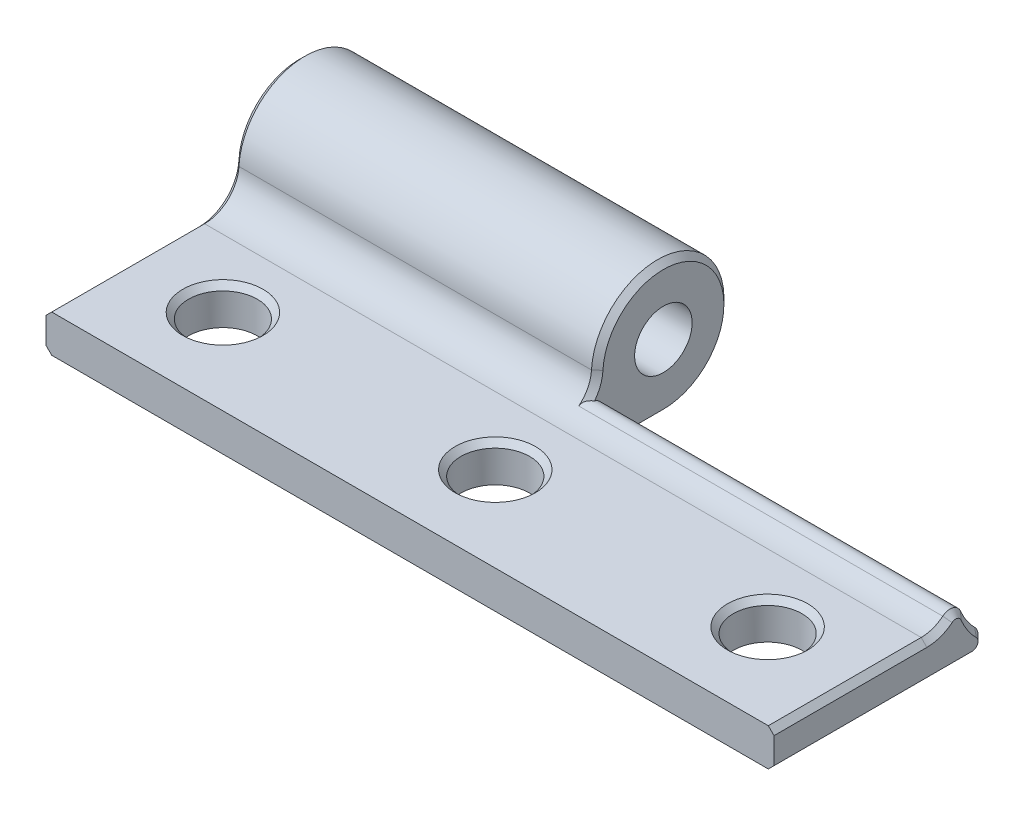
ISO-10303-21;
HEADER;
FILE_DESCRIPTION(('STEP AP214'),'2;1');
FILE_NAME('part.step','',(''),(''),'','','');
FILE_SCHEMA(('AUTOMOTIVE_DESIGN { 1 0 10303 214 1 1 1 1 }'));
ENDSEC;
DATA;
#1=APPLICATION_CONTEXT('core data for automotive mechanical design processes');
#2=APPLICATION_PROTOCOL_DEFINITION('international standard','automotive_design',2000,#1);
#3=PRODUCT_CONTEXT('',#1,'mechanical');
#4=PRODUCT('Part','Part','',(#3));
#5=PRODUCT_RELATED_PRODUCT_CATEGORY('part','',(#4));
#6=PRODUCT_DEFINITION_FORMATION('','',#4);
#7=PRODUCT_DEFINITION_CONTEXT('part definition',#1,'design');
#8=PRODUCT_DEFINITION('design','',#6,#7);
#9=PRODUCT_DEFINITION_SHAPE('','',#8);
#10=(LENGTH_UNIT() NAMED_UNIT(*) SI_UNIT(.MILLI.,.METRE.));
#11=(NAMED_UNIT(*) PLANE_ANGLE_UNIT() SI_UNIT($,.RADIAN.));
#12=(NAMED_UNIT(*) SI_UNIT($,.STERADIAN.) SOLID_ANGLE_UNIT());
#13=UNCERTAINTY_MEASURE_WITH_UNIT(LENGTH_MEASURE(1.E-05),#10,'distance_accuracy_value','');
#14=(GEOMETRIC_REPRESENTATION_CONTEXT(3) GLOBAL_UNCERTAINTY_ASSIGNED_CONTEXT((#13)) GLOBAL_UNIT_ASSIGNED_CONTEXT((#10,
#11,#12)) REPRESENTATION_CONTEXT('',''));
#15=CARTESIAN_POINT('',(0.,0.,0.));
#16=DIRECTION('',(0.,0.,1.));
#17=DIRECTION('',(1.,0.,0.));
#18=AXIS2_PLACEMENT_3D('',#15,#16,#17);
#19=CARTESIAN_POINT('',(31.75,0.490969286456826,8.76580042059178));
#20=DIRECTION('',(1.,0.,0.));
#21=DIRECTION('',(0.,0.,-1.));
#22=AXIS2_PLACEMENT_3D('',#19,#20,#21);
#23=PLANE('',#22);
#24=DIRECTION('',(0.,-1.,0.));
#25=VECTOR('',#24,1.);
#26=CARTESIAN_POINT('',(31.75,-5.77953915953969,22.098));
#27=LINE('',#26,#25);
#28=CARTESIAN_POINT('',(31.75,-3.00903071354318,22.098));
#29=VERTEX_POINT('',#28);
#30=CARTESIAN_POINT('',(31.75,-5.27953915953969,22.098));
#31=VERTEX_POINT('',#30);
#32=EDGE_CURVE('E433',#29,#31,#27,.T.);
#33=ORIENTED_EDGE('',*,*,#32,.T.);
#34=DIRECTION('',(0.,0.,-1.));
#35=VECTOR('',#34,1.);
#36=CARTESIAN_POINT('',(31.75,-5.27953915953969,4.80813442388613));
#37=LINE('',#36,#35);
#38=CARTESIAN_POINT('',(31.75,-5.27953915953969,4.80813442388613));
#39=VERTEX_POINT('',#38);
#40=EDGE_CURVE('E226',#31,#39,#37,.T.);
#41=ORIENTED_EDGE('',*,*,#40,.T.);
#42=CARTESIAN_POINT('',(31.75,-4.77953915953969,4.80813442388613));
#43=DIRECTION('',(1.,0.,0.));
#44=DIRECTION('',(0.,0.,-1.));
#45=AXIS2_PLACEMENT_3D('',#42,#43,#44);
#46=CIRCLE('',#45,0.499999999999999);
#47=CARTESIAN_POINT('',(31.75,-4.42704181074761,4.4535281364425));
#48=VERTEX_POINT('',#47);
#49=EDGE_CURVE('E224',#39,#48,#46,.T.);
#50=ORIENTED_EDGE('',*,*,#49,.T.);
#51=CARTESIAN_POINT('',(31.75,0.,0.));
#52=DIRECTION('',(1.,0.,0.));
#53=DIRECTION('',(0.,0.,-1.));
#54=AXIS2_PLACEMENT_3D('',#51,#52,#53);
#55=CIRCLE('',#54,6.27953915953969);
#56=CARTESIAN_POINT('',(31.75,-2.42752736320503,5.79134897559137));
#57=VERTEX_POINT('',#56);
#58=EDGE_CURVE('E222',#48,#57,#55,.F.);
#59=ORIENTED_EDGE('',*,*,#58,.T.);
#60=CARTESIAN_POINT('',(31.75,-2.62081601875209,6.25247747789503));
#61=DIRECTION('',(1.,0.,0.));
#62=DIRECTION('',(0.,0.,-1.));
#63=AXIS2_PLACEMENT_3D('',#60,#61,#62);
#64=CIRCLE('',#63,0.5);
#65=CARTESIAN_POINT('',(31.75,-2.23184285560098,6.56664284573212));
#66=VERTEX_POINT('',#65);
#67=EDGE_CURVE('E220',#57,#66,#64,.T.);
#68=ORIENTED_EDGE('',*,*,#67,.T.);
#69=CARTESIAN_POINT('',(31.75,0.490969286456826,8.76580042059178));
#70=DIRECTION('',(1.,0.,0.));
#71=DIRECTION('',(0.,0.,-1.));
#72=AXIS2_PLACEMENT_3D('',#69,#70,#71);
#73=CIRCLE('',#72,3.5);
#74=CARTESIAN_POINT('',(31.75,-3.00903071354317,8.76580042059178));
#75=VERTEX_POINT('',#74);
#76=EDGE_CURVE('E218',#66,#75,#73,.F.);
#77=ORIENTED_EDGE('',*,*,#76,.T.);
#78=DIRECTION('',(0.,0.,1.));
#79=VECTOR('',#78,1.);
#80=CARTESIAN_POINT('',(31.75,-3.00903071354318,22.098));
#81=LINE('',#80,#79);
#82=EDGE_CURVE('E216',#75,#29,#81,.T.);
#83=ORIENTED_EDGE('',*,*,#82,.T.);
#84=EDGE_LOOP('',(#33,#41,#50,#59,#68,#77,#83));
#85=FACE_BOUND('',#84,.T.);
#86=ADVANCED_FACE('F33',(#85),#23,.T.);
#87=CARTESIAN_POINT('',(31.75,0.,0.));
#88=DIRECTION('',(-1.,0.,0.));
#89=DIRECTION('',(0.,0.,1.));
#90=AXIS2_PLACEMENT_3D('',#87,#88,#89);
#91=CYLINDRICAL_SURFACE('',#90,5.77953915953969);
#92=DIRECTION('',(-1.,0.,0.));
#93=VECTOR('',#92,1.);
#94=CARTESIAN_POINT('',(31.75,-5.77953915953969,0.));
#95=LINE('',#94,#93);
#96=CARTESIAN_POINT('',(-0.499999999999987,-5.77953915953969,0.));
#97=VERTEX_POINT('',#96);
#98=CARTESIAN_POINT('',(-31.25,-5.77953915953969,0.));
#99=VERTEX_POINT('',#98);
#100=EDGE_CURVE('E437',#97,#99,#95,.T.);
#101=ORIENTED_EDGE('',*,*,#100,.T.);
#102=CARTESIAN_POINT('',(-31.25,0.,0.));
#103=DIRECTION('',(1.,0.,0.));
#104=DIRECTION('',(0.,0.,-1.));
#105=AXIS2_PLACEMENT_3D('',#102,#103,#104);
#106=CIRCLE('',#105,5.77953915953969);
#107=CARTESIAN_POINT('',(-31.25,0.323203321455121,5.77049499693511));
#108=VERTEX_POINT('',#107);
#109=EDGE_CURVE('E265',#99,#108,#106,.T.);
#110=ORIENTED_EDGE('',*,*,#109,.T.);
#111=DIRECTION('',(-1.,0.,0.));
#112=VECTOR('',#111,1.);
#113=CARTESIAN_POINT('',(31.75,0.323203321455121,5.77049499693511));
#114=LINE('',#113,#112);
#115=CARTESIAN_POINT('',(-0.499999999999987,0.323203321455121,5.77049499693511));
#116=VERTEX_POINT('',#115);
#117=EDGE_CURVE('E434',#116,#108,#114,.T.);
#118=ORIENTED_EDGE('',*,*,#117,.F.);
#119=CARTESIAN_POINT('',(-0.499999999999987,0.,0.));
#120=DIRECTION('',(1.,0.,0.));
#121=DIRECTION('',(0.,0.,-1.));
#122=AXIS2_PLACEMENT_3D('',#119,#120,#121);
#123=CIRCLE('',#122,5.77953915953969);
#124=EDGE_CURVE('E263',#116,#97,#123,.F.);
#125=ORIENTED_EDGE('',*,*,#124,.T.);
#126=EDGE_LOOP('',(#101,#110,#118,#125));
#127=FACE_BOUND('',#126,.T.);
#128=ADVANCED_FACE('F349',(#127),#91,.T.);
#129=CARTESIAN_POINT('',(31.75,0.,0.));
#130=DIRECTION('',(-1.,0.,0.));
#131=DIRECTION('',(0.,0.,1.));
#132=AXIS2_PLACEMENT_3D('',#129,#130,#131);
#133=CYLINDRICAL_SURFACE('',#132,2.50903071354317);
#134=CARTESIAN_POINT('',(-31.75,0.,0.));
#135=DIRECTION('',(1.,0.,0.));
#136=DIRECTION('',(0.,0.,-1.));
#137=AXIS2_PLACEMENT_3D('',#134,#135,#136);
#138=CIRCLE('',#137,2.50903071354317);
#139=CARTESIAN_POINT('',(-31.75,0.,-2.50903071354317));
#140=VERTEX_POINT('',#139);
#141=EDGE_CURVE('E440',#140,#140,#138,.T.);
#142=ORIENTED_EDGE('',*,*,#141,.F.);
#143=EDGE_LOOP('',(#142));
#144=FACE_BOUND('',#143,.T.);
#145=CARTESIAN_POINT('',(0.,0.,0.));
#146=DIRECTION('',(1.,0.,0.));
#147=DIRECTION('',(0.,0.,-1.));
#148=AXIS2_PLACEMENT_3D('',#145,#146,#147);
#149=CIRCLE('',#148,2.50903071354317);
#150=CARTESIAN_POINT('',(0.,0.,-2.50903071354317));
#151=VERTEX_POINT('',#150);
#152=EDGE_CURVE('E173',#151,#151,#149,.T.);
#153=ORIENTED_EDGE('',*,*,#152,.T.);
#154=EDGE_LOOP('',(#153));
#155=FACE_BOUND('',#154,.T.);
#156=ADVANCED_FACE('F355',(#144,#155),#133,.F.);
#157=CARTESIAN_POINT('',(-31.75,0.490969286456826,8.76580042059178));
#158=DIRECTION('',(1.,0.,0.));
#159=DIRECTION('',(0.,0.,-1.));
#160=AXIS2_PLACEMENT_3D('',#157,#158,#159);
#161=PLANE('',#160);
#162=DIRECTION('',(0.,-1.,0.));
#163=VECTOR('',#162,1.);
#164=CARTESIAN_POINT('',(-31.75,-5.77953915953969,22.098));
#165=LINE('',#164,#163);
#166=CARTESIAN_POINT('',(-31.75,-3.00903071354317,22.098));
#167=VERTEX_POINT('',#166);
#168=CARTESIAN_POINT('',(-31.75,-5.2795391595397,22.098));
#169=VERTEX_POINT('',#168);
#170=EDGE_CURVE('E435',#167,#169,#165,.T.);
#171=ORIENTED_EDGE('',*,*,#170,.F.);
#172=DIRECTION('',(0.,0.,-1.));
#173=VECTOR('',#172,1.);
#174=CARTESIAN_POINT('',(-31.75,-3.00903071354317,8.76580042059178));
#175=LINE('',#174,#173);
#176=CARTESIAN_POINT('',(-31.75,-3.00903071354317,8.76580042059178));
#177=VERTEX_POINT('',#176);
#178=EDGE_CURVE('E261',#167,#177,#175,.T.);
#179=ORIENTED_EDGE('',*,*,#178,.T.);
#180=CARTESIAN_POINT('',(-31.75,0.490969286456826,8.76580042059178));
#181=DIRECTION('',(1.,0.,0.));
#182=DIRECTION('',(0.,0.,-1.));
#183=AXIS2_PLACEMENT_3D('',#180,#181,#182);
#184=CIRCLE('',#183,3.5);
#185=CARTESIAN_POINT('',(-31.75,0.295242327288171,5.27127742632567));
#186=VERTEX_POINT('',#185);
#187=EDGE_CURVE('E257',#177,#186,#184,.T.);
#188=ORIENTED_EDGE('',*,*,#187,.T.);
#189=CARTESIAN_POINT('',(-31.75,0.,0.));
#190=DIRECTION('',(1.,0.,0.));
#191=DIRECTION('',(0.,0.,-1.));
#192=AXIS2_PLACEMENT_3D('',#189,#190,#191);
#193=CIRCLE('',#192,5.27953915953969);
#194=CARTESIAN_POINT('',(-31.75,-5.27953915953969,0.));
#195=VERTEX_POINT('',#194);
#196=EDGE_CURVE('E255',#186,#195,#193,.F.);
#197=ORIENTED_EDGE('',*,*,#196,.T.);
#198=DIRECTION('',(0.,0.,1.));
#199=VECTOR('',#198,1.);
#200=CARTESIAN_POINT('',(-31.75,-5.27953915953969,8.76580042059178));
#201=LINE('',#200,#199);
#202=EDGE_CURVE('E259',#195,#169,#201,.T.);
#203=ORIENTED_EDGE('',*,*,#202,.T.);
#204=EDGE_LOOP('',(#171,#179,#188,#197,#203));
#205=FACE_BOUND('',#204,.T.);
#206=ORIENTED_EDGE('',*,*,#141,.T.);
#207=EDGE_LOOP('',(#206));
#208=FACE_BOUND('',#207,.T.);
#209=ADVANCED_FACE('F362',(#205,#208),#161,.F.);
#210=CARTESIAN_POINT('',(31.75,0.490969286456826,8.76580042059178));
#211=DIRECTION('',(-1.,0.,0.));
#212=DIRECTION('',(0.,0.,1.));
#213=AXIS2_PLACEMENT_3D('',#210,#211,#212);
#214=CYLINDRICAL_SURFACE('',#213,3.);
#215=DIRECTION('',(-1.,0.,0.));
#216=VECTOR('',#215,1.);
#217=CARTESIAN_POINT('',(31.75,-2.50903071354317,8.76580042059178));
#218=LINE('',#217,#216);
#219=CARTESIAN_POINT('',(31.25,-2.50903071354317,8.76580042059178));
#220=VERTEX_POINT('',#219);
#221=CARTESIAN_POINT('',(-31.25,-2.50903071354317,8.76580042059178));
#222=VERTEX_POINT('',#221);
#223=EDGE_CURVE('E180',#220,#222,#218,.T.);
#224=ORIENTED_EDGE('',*,*,#223,.F.);
#225=CARTESIAN_POINT('',(31.25,0.490969286456826,8.76580042059178));
#226=DIRECTION('',(1.,0.,0.));
#227=DIRECTION('',(0.,0.,-1.));
#228=AXIS2_PLACEMENT_3D('',#225,#226,#227);
#229=CIRCLE('',#228,3.);
#230=CARTESIAN_POINT('',(31.25,-1.84286969244986,6.88080821356921));
#231=VERTEX_POINT('',#230);
#232=EDGE_CURVE('E253',#220,#231,#229,.T.);
#233=ORIENTED_EDGE('',*,*,#232,.T.);
#234=DIRECTION('',(-1.,0.,0.));
#235=VECTOR('',#234,1.);
#236=CARTESIAN_POINT('',(31.75,-1.84286969244986,6.88080821356921));
#237=LINE('',#236,#235);
#238=CARTESIAN_POINT('',(-0.499999999999987,-1.84286969244986,6.88080821356921));
#239=VERTEX_POINT('',#238);
#240=EDGE_CURVE('E191',#231,#239,#237,.T.);
#241=ORIENTED_EDGE('',*,*,#240,.T.);
#242=CARTESIAN_POINT('',(-0.499999999999987,0.490969286456826,8.76580042059178));
#243=DIRECTION('',(1.,0.,0.));
#244=DIRECTION('',(0.,0.,-1.));
#245=AXIS2_PLACEMENT_3D('',#242,#243,#244);
#246=CIRCLE('',#245,3.);
#247=EDGE_CURVE('E249',#239,#116,#246,.T.);
#248=ORIENTED_EDGE('',*,*,#247,.T.);
#249=ORIENTED_EDGE('',*,*,#117,.T.);
#250=CARTESIAN_POINT('',(-31.25,0.490969286456826,8.76580042059178));
#251=DIRECTION('',(1.,0.,0.));
#252=DIRECTION('',(0.,0.,-1.));
#253=AXIS2_PLACEMENT_3D('',#250,#251,#252);
#254=CIRCLE('',#253,3.);
#255=EDGE_CURVE('E251',#108,#222,#254,.F.);
#256=ORIENTED_EDGE('',*,*,#255,.T.);
#257=EDGE_LOOP('',(#224,#233,#241,#248,#249,#256));
#258=FACE_BOUND('',#257,.T.);
#259=ADVANCED_FACE('F364',(#258),#214,.F.);
#260=CARTESIAN_POINT('',(31.75,-2.50903071354318,22.098));
#261=DIRECTION('',(0.,-1.,0.));
#262=DIRECTION('',(0.,0.,-1.));
#263=AXIS2_PLACEMENT_3D('',#260,#261,#262);
#264=PLANE('',#263);
#265=CARTESIAN_POINT('',(23.7558208717441,-2.50903071354317,14.6624614563544));
#266=DIRECTION('',(0.,-1.,0.));
#267=DIRECTION('',(0.,0.,-1.));
#268=AXIS2_PLACEMENT_3D('',#265,#266,#267);
#269=CIRCLE('',#268,3.5);
#270=CARTESIAN_POINT('',(23.7558208717441,-2.50903071354317,11.1624614563544));
#271=VERTEX_POINT('',#270);
#272=EDGE_CURVE('E207',#271,#271,#269,.T.);
#273=ORIENTED_EDGE('',*,*,#272,.T.);
#274=EDGE_LOOP('',(#273));
#275=FACE_BOUND('',#274,.T.);
#276=CARTESIAN_POINT('',(0.,-2.50903071354317,14.6624614563544));
#277=DIRECTION('',(0.,-1.,0.));
#278=DIRECTION('',(0.,0.,-1.));
#279=AXIS2_PLACEMENT_3D('',#276,#277,#278);
#280=CIRCLE('',#279,3.5);
#281=CARTESIAN_POINT('',(0.,-2.50903071354317,11.1624614563544));
#282=VERTEX_POINT('',#281);
#283=EDGE_CURVE('E204',#282,#282,#280,.T.);
#284=ORIENTED_EDGE('',*,*,#283,.T.);
#285=EDGE_LOOP('',(#284));
#286=FACE_BOUND('',#285,.T.);
#287=CARTESIAN_POINT('',(-23.7558208717441,-2.50903071354317,14.6624614563544));
#288=DIRECTION('',(0.,-1.,0.));
#289=DIRECTION('',(0.,0.,-1.));
#290=AXIS2_PLACEMENT_3D('',#287,#288,#289);
#291=CIRCLE('',#290,3.5);
#292=CARTESIAN_POINT('',(-23.7558208717441,-2.50903071354317,11.1624614563544));
#293=VERTEX_POINT('',#292);
#294=EDGE_CURVE('E201',#293,#293,#291,.T.);
#295=ORIENTED_EDGE('',*,*,#294,.T.);
#296=EDGE_LOOP('',(#295));
#297=FACE_BOUND('',#296,.T.);
#298=DIRECTION('',(-1.,0.,0.));
#299=VECTOR('',#298,1.);
#300=CARTESIAN_POINT('',(31.75,-2.50903071354318,22.098));
#301=LINE('',#300,#299);
#302=CARTESIAN_POINT('',(31.25,-2.50903071354318,22.098));
#303=VERTEX_POINT('',#302);
#304=CARTESIAN_POINT('',(-31.25,-2.50903071354318,22.098));
#305=VERTEX_POINT('',#304);
#306=EDGE_CURVE('E185',#303,#305,#301,.T.);
#307=ORIENTED_EDGE('',*,*,#306,.F.);
#308=DIRECTION('',(0.,0.,-1.));
#309=VECTOR('',#308,1.);
#310=CARTESIAN_POINT('',(31.25,-2.50903071354317,8.76580042059178));
#311=LINE('',#310,#309);
#312=EDGE_CURVE('E199',#303,#220,#311,.T.);
#313=ORIENTED_EDGE('',*,*,#312,.T.);
#314=ORIENTED_EDGE('',*,*,#223,.T.);
#315=DIRECTION('',(0.,0.,1.));
#316=VECTOR('',#315,1.);
#317=CARTESIAN_POINT('',(-31.25,-2.50903071354318,22.098));
#318=LINE('',#317,#316);
#319=EDGE_CURVE('E196',#222,#305,#318,.T.);
#320=ORIENTED_EDGE('',*,*,#319,.T.);
#321=EDGE_LOOP('',(#307,#313,#314,#320));
#322=FACE_BOUND('',#321,.T.);
#323=ADVANCED_FACE('F374',(#275,#286,#297,#322),#264,.F.);
#324=CARTESIAN_POINT('',(31.75,-5.77953915953969,22.098));
#325=DIRECTION('',(0.,0.,-1.));
#326=DIRECTION('',(-1.,0.,0.));
#327=AXIS2_PLACEMENT_3D('',#324,#325,#326);
#328=PLANE('',#327);
#329=DIRECTION('',(-1.,0.,0.));
#330=VECTOR('',#329,1.);
#331=CARTESIAN_POINT('',(31.75,-5.77953915953969,22.098));
#332=LINE('',#331,#330);
#333=CARTESIAN_POINT('',(31.25,-5.77953915953969,22.098));
#334=VERTEX_POINT('',#333);
#335=CARTESIAN_POINT('',(-31.25,-5.77953915953969,22.098));
#336=VERTEX_POINT('',#335);
#337=EDGE_CURVE('E446',#334,#336,#332,.T.);
#338=ORIENTED_EDGE('',*,*,#337,.F.);
#339=DIRECTION('',(0.707106781186548,0.707106781186547,0.));
#340=VECTOR('',#339,1.);
#341=CARTESIAN_POINT('',(31.75,-5.27953915953969,22.098));
#342=LINE('',#341,#340);
#343=EDGE_CURVE('E242',#334,#31,#342,.T.);
#344=ORIENTED_EDGE('',*,*,#343,.T.);
#345=ORIENTED_EDGE('',*,*,#32,.F.);
#346=DIRECTION('',(-0.707106781186548,0.707106781186548,0.));
#347=VECTOR('',#346,1.);
#348=CARTESIAN_POINT('',(31.75,-3.00903071354318,22.098));
#349=LINE('',#348,#347);
#350=EDGE_CURVE('E240',#29,#303,#349,.T.);
#351=ORIENTED_EDGE('',*,*,#350,.T.);
#352=ORIENTED_EDGE('',*,*,#306,.T.);
#353=DIRECTION('',(0.70710678118655,0.707106781186545,0.));
#354=VECTOR('',#353,1.);
#355=CARTESIAN_POINT('',(-31.25,-2.50903071354318,22.098));
#356=LINE('',#355,#354);
#357=EDGE_CURVE('E238',#305,#167,#356,.F.);
#358=ORIENTED_EDGE('',*,*,#357,.T.);
#359=ORIENTED_EDGE('',*,*,#170,.T.);
#360=DIRECTION('',(-0.70710678118655,0.707106781186545,0.));
#361=VECTOR('',#360,1.);
#362=CARTESIAN_POINT('',(-31.25,-5.77953915953969,22.098));
#363=LINE('',#362,#361);
#364=EDGE_CURVE('E236',#169,#336,#363,.F.);
#365=ORIENTED_EDGE('',*,*,#364,.T.);
#366=EDGE_LOOP('',(#338,#344,#345,#351,#352,#358,#359,#365));
#367=FACE_BOUND('',#366,.T.);
#368=ADVANCED_FACE('F370',(#367),#328,.F.);
#369=CARTESIAN_POINT('',(31.75,-5.77953915953969,0.));
#370=DIRECTION('',(0.,1.,0.));
#371=DIRECTION('',(0.,0.,1.));
#372=AXIS2_PLACEMENT_3D('',#369,#370,#371);
#373=PLANE('',#372);
#374=CARTESIAN_POINT('',(0.,-5.77953915953969,14.6624614563544));
#375=DIRECTION('',(0.,1.,0.));
#376=DIRECTION('',(0.,0.,1.));
#377=AXIS2_PLACEMENT_3D('',#374,#375,#376);
#378=CIRCLE('',#377,3.);
#379=CARTESIAN_POINT('',(0.,-5.77953915953969,17.6624614563544));
#380=VERTEX_POINT('',#379);
#381=EDGE_CURVE('E497',#380,#380,#378,.T.);
#382=ORIENTED_EDGE('',*,*,#381,.T.);
#383=EDGE_LOOP('',(#382));
#384=FACE_BOUND('',#383,.T.);
#385=CARTESIAN_POINT('',(23.7558208717441,-5.77953915953969,14.6624614563544));
#386=DIRECTION('',(0.,1.,0.));
#387=DIRECTION('',(0.,0.,1.));
#388=AXIS2_PLACEMENT_3D('',#385,#386,#387);
#389=CIRCLE('',#388,2.99999999999999);
#390=CARTESIAN_POINT('',(23.7558208717441,-5.77953915953969,17.6624614563544));
#391=VERTEX_POINT('',#390);
#392=EDGE_CURVE('E395',#391,#391,#389,.T.);
#393=ORIENTED_EDGE('',*,*,#392,.T.);
#394=EDGE_LOOP('',(#393));
#395=FACE_BOUND('',#394,.T.);
#396=CARTESIAN_POINT('',(-23.7558208717441,-5.77953915953969,14.6624614563544));
#397=DIRECTION('',(0.,1.,0.));
#398=DIRECTION('',(0.,0.,1.));
#399=AXIS2_PLACEMENT_3D('',#396,#397,#398);
#400=CIRCLE('',#399,2.99999999999999);
#401=CARTESIAN_POINT('',(-23.7558208717441,-5.77953915953969,17.6624614563544));
#402=VERTEX_POINT('',#401);
#403=EDGE_CURVE('E174',#402,#402,#400,.T.);
#404=ORIENTED_EDGE('',*,*,#403,.T.);
#405=EDGE_LOOP('',(#404));
#406=FACE_BOUND('',#405,.T.);
#407=DIRECTION('',(1.,0.,0.));
#408=VECTOR('',#407,1.);
#409=CARTESIAN_POINT('',(31.75,-5.77953915953969,4.80813442388613));
#410=LINE('',#409,#408);
#411=CARTESIAN_POINT('',(-0.499999999999987,-5.77953915953969,4.80813442388613));
#412=VERTEX_POINT('',#411);
#413=CARTESIAN_POINT('',(31.25,-5.77953915953969,4.80813442388613));
#414=VERTEX_POINT('',#413);
#415=EDGE_CURVE('E182',#412,#414,#410,.T.);
#416=ORIENTED_EDGE('',*,*,#415,.T.);
#417=DIRECTION('',(0.,0.,1.));
#418=VECTOR('',#417,1.);
#419=CARTESIAN_POINT('',(31.25,-5.77953915953969,22.098));
#420=LINE('',#419,#418);
#421=EDGE_CURVE('E234',#414,#334,#420,.T.);
#422=ORIENTED_EDGE('',*,*,#421,.T.);
#423=ORIENTED_EDGE('',*,*,#337,.T.);
#424=DIRECTION('',(0.,0.,-1.));
#425=VECTOR('',#424,1.);
#426=CARTESIAN_POINT('',(-31.25,-5.77953915953969,0.));
#427=LINE('',#426,#425);
#428=EDGE_CURVE('E232',#336,#99,#427,.T.);
#429=ORIENTED_EDGE('',*,*,#428,.T.);
#430=ORIENTED_EDGE('',*,*,#100,.F.);
#431=DIRECTION('',(0.,0.,1.));
#432=VECTOR('',#431,1.);
#433=CARTESIAN_POINT('',(-0.499999999999987,-5.77953915953969,4.80813442388613));
#434=LINE('',#433,#432);
#435=EDGE_CURVE('E229',#97,#412,#434,.T.);
#436=ORIENTED_EDGE('',*,*,#435,.T.);
#437=EDGE_LOOP('',(#416,#422,#423,#429,#430,#436));
#438=FACE_BOUND('',#437,.T.);
#439=ADVANCED_FACE('F367',(#384,#395,#406,#438),#373,.F.);
#440=CARTESIAN_POINT('',(63.5,0.,0.));
#441=DIRECTION('',(-1.,0.,0.));
#442=DIRECTION('',(0.,0.,1.));
#443=AXIS2_PLACEMENT_3D('',#440,#441,#442);
#444=CYLINDRICAL_SURFACE('',#443,5.77953915953969);
#445=DIRECTION('',(-1.,0.,0.));
#446=VECTOR('',#445,1.);
#447=CARTESIAN_POINT('',(63.5,-2.23423870765798,5.33022047328772));
#448=LINE('',#447,#446);
#449=CARTESIAN_POINT('',(0.,-2.23423870765798,5.33022047328772));
#450=VERTEX_POINT('',#449);
#451=CARTESIAN_POINT('',(31.25,-2.23423870765798,5.33022047328772));
#452=VERTEX_POINT('',#451);
#453=EDGE_CURVE('E168',#450,#452,#448,.F.);
#454=ORIENTED_EDGE('',*,*,#453,.T.);
#455=CARTESIAN_POINT('',(31.25,0.,0.));
#456=DIRECTION('',(1.,0.,0.));
#457=DIRECTION('',(0.,0.,-1.));
#458=AXIS2_PLACEMENT_3D('',#455,#456,#457);
#459=CIRCLE('',#458,5.77953915953969);
#460=CARTESIAN_POINT('',(31.25,-4.07454446195552,4.09892184899887));
#461=VERTEX_POINT('',#460);
#462=EDGE_CURVE('E246',#452,#461,#459,.T.);
#463=ORIENTED_EDGE('',*,*,#462,.T.);
#464=DIRECTION('',(-1.,0.,0.));
#465=VECTOR('',#464,1.);
#466=CARTESIAN_POINT('',(63.5,-4.07454446195552,4.09892184899887));
#467=LINE('',#466,#465);
#468=CARTESIAN_POINT('',(0.,-4.07454446195552,4.09892184899887));
#469=VERTEX_POINT('',#468);
#470=EDGE_CURVE('E171',#461,#469,#467,.T.);
#471=ORIENTED_EDGE('',*,*,#470,.T.);
#472=CARTESIAN_POINT('',(0.,0.,0.));
#473=DIRECTION('',(1.,0.,0.));
#474=DIRECTION('',(0.,0.,-1.));
#475=AXIS2_PLACEMENT_3D('',#472,#473,#474);
#476=CIRCLE('',#475,5.77953915953969);
#477=EDGE_CURVE('E157',#450,#469,#476,.T.);
#478=ORIENTED_EDGE('',*,*,#477,.F.);
#479=EDGE_LOOP('',(#454,#463,#471,#478));
#480=FACE_BOUND('',#479,.T.);
#481=ADVANCED_FACE('F167',(#480),#444,.F.);
#482=CARTESIAN_POINT('',(0.,0.,0.));
#483=DIRECTION('',(1.,0.,0.));
#484=DIRECTION('',(0.,0.,-1.));
#485=AXIS2_PLACEMENT_3D('',#482,#483,#484);
#486=PLANE('',#485);
#487=CARTESIAN_POINT('',(0.,-4.77953915953969,4.80813442388613));
#488=DIRECTION('',(1.,0.,0.));
#489=DIRECTION('',(0.,0.,-1.));
#490=AXIS2_PLACEMENT_3D('',#487,#488,#489);
#491=CIRCLE('',#490,1.);
#492=CARTESIAN_POINT('',(0.,-5.27953915953971,3.9421090201017));
#493=VERTEX_POINT('',#492);
#494=EDGE_CURVE('E163',#469,#493,#491,.F.);
#495=ORIENTED_EDGE('',*,*,#494,.T.);
#496=DIRECTION('',(0.,0.,-1.));
#497=VECTOR('',#496,1.);
#498=CARTESIAN_POINT('',(0.,-5.27953915953971,0.));
#499=LINE('',#498,#497);
#500=CARTESIAN_POINT('',(0.,-5.27953915953971,0.));
#501=VERTEX_POINT('',#500);
#502=EDGE_CURVE('E56',#493,#501,#499,.T.);
#503=ORIENTED_EDGE('',*,*,#502,.T.);
#504=CARTESIAN_POINT('',(0.,0.,0.));
#505=DIRECTION('',(1.,0.,0.));
#506=DIRECTION('',(0.,0.,-1.));
#507=AXIS2_PLACEMENT_3D('',#504,#505,#506);
#508=CIRCLE('',#507,5.27953915953971);
#509=CARTESIAN_POINT('',(0.,0.295242327288172,5.27127742632568));
#510=VERTEX_POINT('',#509);
#511=EDGE_CURVE('E51',#501,#510,#508,.T.);
#512=ORIENTED_EDGE('',*,*,#511,.T.);
#513=CARTESIAN_POINT('',(0.,0.490969286456826,8.76580042059178));
#514=DIRECTION('',(1.,0.,0.));
#515=DIRECTION('',(0.,0.,-1.));
#516=AXIS2_PLACEMENT_3D('',#513,#514,#515);
#517=CIRCLE('',#516,3.49999999999998);
#518=CARTESIAN_POINT('',(0.,-1.65332432849952,5.99957467187615));
#519=VERTEX_POINT('',#518);
#520=EDGE_CURVE('E158',#510,#519,#517,.F.);
#521=ORIENTED_EDGE('',*,*,#520,.T.);
#522=CARTESIAN_POINT('',(0.,-2.62081601875209,6.25247747789503));
#523=DIRECTION('',(1.,0.,0.));
#524=DIRECTION('',(0.,0.,-1.));
#525=AXIS2_PLACEMENT_3D('',#522,#523,#524);
#526=CIRCLE('',#525,1.);
#527=EDGE_CURVE('E153',#519,#450,#526,.F.);
#528=ORIENTED_EDGE('',*,*,#527,.T.);
#529=ORIENTED_EDGE('',*,*,#477,.T.);
#530=EDGE_LOOP('',(#495,#503,#512,#521,#528,#529));
#531=FACE_BOUND('',#530,.T.);
#532=ORIENTED_EDGE('',*,*,#152,.F.);
#533=EDGE_LOOP('',(#532));
#534=FACE_BOUND('',#533,.T.);
#535=ADVANCED_FACE('F155',(#531,#534),#486,.T.);
#536=CARTESIAN_POINT('',(63.5,-4.77953915953969,4.80813442388613));
#537=DIRECTION('',(-1.,0.,0.));
#538=DIRECTION('',(0.,0.,1.));
#539=AXIS2_PLACEMENT_3D('',#536,#537,#538);
#540=CYLINDRICAL_SURFACE('',#539,1.);
#541=ORIENTED_EDGE('',*,*,#470,.F.);
#542=CARTESIAN_POINT('',(31.25,-4.77953915953969,4.80813442388613));
#543=DIRECTION('',(1.,0.,0.));
#544=DIRECTION('',(0.,0.,-1.));
#545=AXIS2_PLACEMENT_3D('',#542,#543,#544);
#546=CIRCLE('',#545,1.);
#547=EDGE_CURVE('E244',#461,#414,#546,.F.);
#548=ORIENTED_EDGE('',*,*,#547,.T.);
#549=ORIENTED_EDGE('',*,*,#415,.F.);
#550=CARTESIAN_POINT('',(0.500000000000028,-4.77953915953969,4.80813442388613));
#551=DIRECTION('',(0.707106781186543,-0.707106781186552,0.));
#552=DIRECTION('',(-0.707106781186552,-0.707106781186543,0.));
#553=AXIS2_PLACEMENT_3D('',#550,#551,#552);
#554=ELLIPSE('',#553,1.4142135623731,1.);
#555=EDGE_CURVE('E43',#412,#493,#554,.T.);
#556=ORIENTED_EDGE('',*,*,#555,.T.);
#557=ORIENTED_EDGE('',*,*,#494,.F.);
#558=EDGE_LOOP('',(#541,#548,#549,#556,#557));
#559=FACE_BOUND('',#558,.T.);
#560=ADVANCED_FACE('F282',(#559),#540,.T.);
#561=CARTESIAN_POINT('',(63.5,-2.62081601875209,6.25247747789503));
#562=DIRECTION('',(-1.,0.,0.));
#563=DIRECTION('',(0.,0.,1.));
#564=AXIS2_PLACEMENT_3D('',#561,#562,#563);
#565=CYLINDRICAL_SURFACE('',#564,1.);
#566=ORIENTED_EDGE('',*,*,#240,.F.);
#567=CARTESIAN_POINT('',(31.25,-2.62081601875209,6.25247747789503));
#568=DIRECTION('',(1.,0.,0.));
#569=DIRECTION('',(0.,0.,-1.));
#570=AXIS2_PLACEMENT_3D('',#567,#568,#569);
#571=CIRCLE('',#570,1.);
#572=EDGE_CURVE('E179',#231,#452,#571,.F.);
#573=ORIENTED_EDGE('',*,*,#572,.T.);
#574=ORIENTED_EDGE('',*,*,#453,.F.);
#575=ORIENTED_EDGE('',*,*,#527,.F.);
#576=CARTESIAN_POINT('',(0.,-1.65332432849952,5.99957467187615));
#577=CARTESIAN_POINT('',(-0.0284153490064831,-1.64551690028822,6.02948600183226));
#578=CARTESIAN_POINT('',(-0.0565213119769254,-1.63899552176896,6.06006249361166));
#579=CARTESIAN_POINT('',(-0.111882480452566,-1.6287691294739,6.12263851933411));
#580=CARTESIAN_POINT('',(-0.139134032054321,-1.62507495289926,6.15464303627588));
#581=CARTESIAN_POINT('',(-0.192773652697333,-1.62077550103929,6.22048080358005));
#582=CARTESIAN_POINT('',(-0.219139901362869,-1.62022247793319,6.25433558183454));
#583=CARTESIAN_POINT('',(-0.269955255024226,-1.62272909609076,6.32325828152786));
#584=CARTESIAN_POINT('',(-0.294407596396772,-1.62578249180989,6.35832400390332));
#585=CARTESIAN_POINT('',(-0.341500862468502,-1.63613633919198,6.43077366007412));
#586=CARTESIAN_POINT('',(-0.364054633185596,-1.64357450122958,6.46819590745014));
#587=CARTESIAN_POINT('',(-0.405224821181066,-1.66338605602336,6.5437564051895));
#588=CARTESIAN_POINT('',(-0.423857225981022,-1.67573879157977,6.58189102979399));
#589=CARTESIAN_POINT('',(-0.453422833580564,-1.70360323295406,6.65238914387016));
#590=CARTESIAN_POINT('',(-0.465098093218823,-1.71834159933291,6.68474219914289));
#591=CARTESIAN_POINT('',(-0.483735157873556,-1.75187144857793,6.74869258745864));
#592=CARTESIAN_POINT('',(-0.490706540005534,-1.77065459270993,6.78029132890538));
#593=CARTESIAN_POINT('',(-0.496644762773917,-1.79935086407793,6.82292008296937));
#594=CARTESIAN_POINT('',(-0.497900270152984,-1.80768402866842,6.83473725279639));
#595=CARTESIAN_POINT('',(-0.499578118769236,-1.82488438148191,6.85803681515262));
#596=CARTESIAN_POINT('',(-0.500000478067629,-1.83375155812415,6.86951921493375));
#597=CARTESIAN_POINT('',(-0.499999999999994,-1.84286969244986,6.88080821356922));
#598=B_SPLINE_CURVE_WITH_KNOTS('',3,(#576,#577,#578,#579,#580,#581,#582,#583,#584,#585,#586,
#587,#588,#589,#590,#591,#592,#593,#594,#595,#596,#597),.UNSPECIFIED.,.F.,.F.,(4,2,2,2,2,2,2,2,
2,2,4),(0.,0.125978481066239,0.252437475801434,0.380994053759115,0.509328325312555,
0.641925633119262,0.773971391367623,0.885797942547632,0.997396121758366,1.04090777292144,
1.08441848081684),.UNSPECIFIED.);
#599=EDGE_CURVE('E11',#519,#239,#598,.T.);
#600=ORIENTED_EDGE('',*,*,#599,.T.);
#601=EDGE_LOOP('',(#566,#573,#574,#575,#600));
#602=FACE_BOUND('',#601,.T.);
#603=ADVANCED_FACE('F177',(#602),#565,.T.);
#604=CARTESIAN_POINT('',(-23.7558208717441,-5.77953915953969,14.6624614563544));
#605=DIRECTION('',(0.,1.,0.));
#606=DIRECTION('',(0.,0.,1.));
#607=AXIS2_PLACEMENT_3D('',#604,#605,#606);
#608=CYLINDRICAL_SURFACE('',#607,2.99999999999999);
#609=CARTESIAN_POINT('',(-23.7558208717441,-3.00903071354317,14.6624614563544));
#610=DIRECTION('',(0.,-1.,0.));
#611=DIRECTION('',(0.,0.,-1.));
#612=AXIS2_PLACEMENT_3D('',#609,#610,#611);
#613=CIRCLE('',#612,2.99999999999999);
#614=CARTESIAN_POINT('',(-23.7558208717441,-3.00903071354317,11.6624614563544));
#615=VERTEX_POINT('',#614);
#616=EDGE_CURVE('E213',#615,#615,#613,.F.);
#617=ORIENTED_EDGE('',*,*,#616,.T.);
#618=EDGE_LOOP('',(#617));
#619=FACE_BOUND('',#618,.T.);
#620=ORIENTED_EDGE('',*,*,#403,.F.);
#621=EDGE_LOOP('',(#620));
#622=FACE_BOUND('',#621,.T.);
#623=ADVANCED_FACE('F281',(#619,#622),#608,.F.);
#624=CARTESIAN_POINT('',(23.7558208717441,-5.77953915953969,14.6624614563544));
#625=DIRECTION('',(0.,1.,0.));
#626=DIRECTION('',(0.,0.,1.));
#627=AXIS2_PLACEMENT_3D('',#624,#625,#626);
#628=CYLINDRICAL_SURFACE('',#627,2.99999999999999);
#629=CARTESIAN_POINT('',(23.7558208717441,-3.00903071354317,14.6624614563544));
#630=DIRECTION('',(0.,-1.,0.));
#631=DIRECTION('',(0.,0.,-1.));
#632=AXIS2_PLACEMENT_3D('',#629,#630,#631);
#633=CIRCLE('',#632,2.99999999999999);
#634=CARTESIAN_POINT('',(23.7558208717441,-3.00903071354317,11.6624614563544));
#635=VERTEX_POINT('',#634);
#636=EDGE_CURVE('E162',#635,#635,#633,.F.);
#637=ORIENTED_EDGE('',*,*,#636,.T.);
#638=EDGE_LOOP('',(#637));
#639=FACE_BOUND('',#638,.T.);
#640=ORIENTED_EDGE('',*,*,#392,.F.);
#641=EDGE_LOOP('',(#640));
#642=FACE_BOUND('',#641,.T.);
#643=ADVANCED_FACE('F484',(#639,#642),#628,.F.);
#644=CARTESIAN_POINT('',(0.,-5.77953915953969,14.6624614563544));
#645=DIRECTION('',(0.,1.,0.));
#646=DIRECTION('',(0.,0.,1.));
#647=AXIS2_PLACEMENT_3D('',#644,#645,#646);
#648=CYLINDRICAL_SURFACE('',#647,3.);
#649=CARTESIAN_POINT('',(0.,-3.00903071354317,14.6624614563544));
#650=DIRECTION('',(0.,-1.,0.));
#651=DIRECTION('',(0.,0.,-1.));
#652=AXIS2_PLACEMENT_3D('',#649,#650,#651);
#653=CIRCLE('',#652,3.);
#654=CARTESIAN_POINT('',(0.,-3.00903071354317,11.6624614563544));
#655=VERTEX_POINT('',#654);
#656=EDGE_CURVE('E210',#655,#655,#653,.F.);
#657=ORIENTED_EDGE('',*,*,#656,.T.);
#658=EDGE_LOOP('',(#657));
#659=FACE_BOUND('',#658,.T.);
#660=ORIENTED_EDGE('',*,*,#381,.F.);
#661=EDGE_LOOP('',(#660));
#662=FACE_BOUND('',#661,.T.);
#663=ADVANCED_FACE('F288',(#659,#662),#648,.F.);
#664=CARTESIAN_POINT('',(23.7558208717441,-3.00903071354317,14.6624614563544));
#665=DIRECTION('',(0.,1.,0.));
#666=DIRECTION('',(0.,0.,1.));
#667=AXIS2_PLACEMENT_3D('',#664,#665,#666);
#668=CONICAL_SURFACE('',#667,2.99999999999999,0.785398163397453);
#669=ORIENTED_EDGE('',*,*,#272,.F.);
#670=EDGE_LOOP('',(#669));
#671=FACE_BOUND('',#670,.T.);
#672=ORIENTED_EDGE('',*,*,#636,.F.);
#673=EDGE_LOOP('',(#672));
#674=FACE_BOUND('',#673,.T.);
#675=ADVANCED_FACE('F284',(#671,#674),#668,.F.);
#676=CARTESIAN_POINT('',(0.,-3.00903071354317,14.6624614563544));
#677=DIRECTION('',(0.,1.,0.));
#678=DIRECTION('',(0.,0.,1.));
#679=AXIS2_PLACEMENT_3D('',#676,#677,#678);
#680=CONICAL_SURFACE('',#679,3.,0.785398163397452);
#681=ORIENTED_EDGE('',*,*,#283,.F.);
#682=EDGE_LOOP('',(#681));
#683=FACE_BOUND('',#682,.T.);
#684=ORIENTED_EDGE('',*,*,#656,.F.);
#685=EDGE_LOOP('',(#684));
#686=FACE_BOUND('',#685,.T.);
#687=ADVANCED_FACE('F287',(#683,#686),#680,.F.);
#688=CARTESIAN_POINT('',(-23.7558208717441,-3.00903071354317,14.6624614563544));
#689=DIRECTION('',(0.,1.,0.));
#690=DIRECTION('',(0.,0.,1.));
#691=AXIS2_PLACEMENT_3D('',#688,#689,#690);
#692=CONICAL_SURFACE('',#691,2.99999999999999,0.785398163397453);
#693=ORIENTED_EDGE('',*,*,#294,.F.);
#694=EDGE_LOOP('',(#693));
#695=FACE_BOUND('',#694,.T.);
#696=ORIENTED_EDGE('',*,*,#616,.F.);
#697=EDGE_LOOP('',(#696));
#698=FACE_BOUND('',#697,.T.);
#699=ADVANCED_FACE('F292',(#695,#698),#692,.F.);
#700=CARTESIAN_POINT('',(31.75,-3.00903071354317,8.76580042059178));
#701=DIRECTION('',(0.707106781186547,0.707106781186547,0.));
#702=DIRECTION('',(0.,0.,-1.));
#703=AXIS2_PLACEMENT_3D('',#700,#701,#702);
#704=PLANE('',#703);
#705=ORIENTED_EDGE('',*,*,#350,.F.);
#706=ORIENTED_EDGE('',*,*,#82,.F.);
#707=DIRECTION('',(0.707106781186547,-0.707106781186547,0.));
#708=VECTOR('',#707,1.);
#709=CARTESIAN_POINT('',(31.25,-2.50903071354317,8.76580042059178));
#710=LINE('',#709,#708);
#711=EDGE_CURVE('E392',#220,#75,#710,.T.);
#712=ORIENTED_EDGE('',*,*,#711,.F.);
#713=ORIENTED_EDGE('',*,*,#312,.F.);
#714=EDGE_LOOP('',(#705,#706,#712,#713));
#715=FACE_BOUND('',#714,.T.);
#716=ADVANCED_FACE('F296',(#715),#704,.T.);
#717=CARTESIAN_POINT('',(31.75,0.490969286456826,8.76580042059178));
#718=DIRECTION('',(1.,0.,0.));
#719=DIRECTION('',(0.,0.,-1.));
#720=AXIS2_PLACEMENT_3D('',#717,#718,#719);
#721=CONICAL_SURFACE('',#720,3.5,0.785398163397448);
#722=ORIENTED_EDGE('',*,*,#711,.T.);
#723=ORIENTED_EDGE('',*,*,#76,.F.);
#724=DIRECTION('',(0.707106781186547,-0.550091122727469,-0.44429692402315));
#725=VECTOR('',#724,1.);
#726=CARTESIAN_POINT('',(31.25,-1.84286969244986,6.88080821356921));
#727=LINE('',#726,#725);
#728=EDGE_CURVE('E396',#231,#66,#727,.T.);
#729=ORIENTED_EDGE('',*,*,#728,.F.);
#730=ORIENTED_EDGE('',*,*,#232,.F.);
#731=EDGE_LOOP('',(#722,#723,#729,#730));
#732=FACE_BOUND('',#731,.T.);
#733=ADVANCED_FACE('F314',(#732),#721,.F.);
#734=CARTESIAN_POINT('',(31.75,-2.62081601875209,6.25247747789503));
#735=DIRECTION('',(-1.,0.,0.));
#736=DIRECTION('',(0.,0.,1.));
#737=AXIS2_PLACEMENT_3D('',#734,#735,#736);
#738=CONICAL_SURFACE('',#737,0.5,0.785398163397448);
#739=ORIENTED_EDGE('',*,*,#728,.T.);
#740=ORIENTED_EDGE('',*,*,#67,.F.);
#741=DIRECTION('',(0.707106781186547,-0.273351438127508,0.652134181954621));
#742=VECTOR('',#741,1.);
#743=CARTESIAN_POINT('',(31.25,-2.23423870765798,5.33022047328772));
#744=LINE('',#743,#742);
#745=EDGE_CURVE('E401',#452,#57,#744,.T.);
#746=ORIENTED_EDGE('',*,*,#745,.F.);
#747=ORIENTED_EDGE('',*,*,#572,.F.);
#748=EDGE_LOOP('',(#739,#740,#746,#747));
#749=FACE_BOUND('',#748,.T.);
#750=ADVANCED_FACE('F310',(#749),#738,.T.);
#751=CARTESIAN_POINT('',(31.75,0.,0.));
#752=DIRECTION('',(1.,0.,0.));
#753=DIRECTION('',(0.,0.,-1.));
#754=AXIS2_PLACEMENT_3D('',#751,#752,#753);
#755=CONICAL_SURFACE('',#754,6.27953915953969,0.785398163397448);
#756=ORIENTED_EDGE('',*,*,#745,.T.);
#757=ORIENTED_EDGE('',*,*,#58,.F.);
#758=DIRECTION('',(0.707106781186547,-0.498506531362323,0.501489021005551));
#759=VECTOR('',#758,1.);
#760=CARTESIAN_POINT('',(31.25,-4.07454446195552,4.09892184899887));
#761=LINE('',#760,#759);
#762=EDGE_CURVE('E406',#461,#48,#761,.T.);
#763=ORIENTED_EDGE('',*,*,#762,.F.);
#764=ORIENTED_EDGE('',*,*,#462,.F.);
#765=EDGE_LOOP('',(#756,#757,#763,#764));
#766=FACE_BOUND('',#765,.T.);
#767=ADVANCED_FACE('F306',(#766),#755,.F.);
#768=CARTESIAN_POINT('',(31.75,-4.77953915953969,4.80813442388613));
#769=DIRECTION('',(-1.,0.,0.));
#770=DIRECTION('',(0.,0.,1.));
#771=AXIS2_PLACEMENT_3D('',#768,#769,#770);
#772=CONICAL_SURFACE('',#771,0.5,0.785398163397448);
#773=ORIENTED_EDGE('',*,*,#762,.T.);
#774=ORIENTED_EDGE('',*,*,#49,.F.);
#775=DIRECTION('',(0.707106781186547,0.707106781186547,0.));
#776=VECTOR('',#775,1.);
#777=CARTESIAN_POINT('',(31.25,-5.77953915953969,4.80813442388613));
#778=LINE('',#777,#776);
#779=EDGE_CURVE('E275',#414,#39,#778,.T.);
#780=ORIENTED_EDGE('',*,*,#779,.F.);
#781=ORIENTED_EDGE('',*,*,#547,.F.);
#782=EDGE_LOOP('',(#773,#774,#780,#781));
#783=FACE_BOUND('',#782,.T.);
#784=ADVANCED_FACE('F302',(#783),#772,.T.);
#785=CARTESIAN_POINT('',(31.75,-5.27953915953969,8.76580042059178));
#786=DIRECTION('',(0.707106781186547,-0.707106781186548,0.));
#787=DIRECTION('',(0.,0.,1.));
#788=AXIS2_PLACEMENT_3D('',#785,#786,#787);
#789=PLANE('',#788);
#790=ORIENTED_EDGE('',*,*,#343,.F.);
#791=ORIENTED_EDGE('',*,*,#421,.F.);
#792=ORIENTED_EDGE('',*,*,#779,.T.);
#793=ORIENTED_EDGE('',*,*,#40,.F.);
#794=EDGE_LOOP('',(#790,#791,#792,#793));
#795=FACE_BOUND('',#794,.T.);
#796=ADVANCED_FACE('F298',(#795),#789,.T.);
#797=CARTESIAN_POINT('',(-31.25,-5.77953915953969,0.));
#798=DIRECTION('',(0.707106781186545,0.70710678118655,0.));
#799=DIRECTION('',(0.,0.,-1.));
#800=AXIS2_PLACEMENT_3D('',#797,#798,#799);
#801=PLANE('',#800);
#802=ORIENTED_EDGE('',*,*,#364,.F.);
#803=ORIENTED_EDGE('',*,*,#202,.F.);
#804=DIRECTION('',(-0.707106781186551,0.707106781186544,0.));
#805=VECTOR('',#804,1.);
#806=CARTESIAN_POINT('',(-31.25,-5.77953915953969,0.));
#807=LINE('',#806,#805);
#808=EDGE_CURVE('E420',#99,#195,#807,.T.);
#809=ORIENTED_EDGE('',*,*,#808,.F.);
#810=ORIENTED_EDGE('',*,*,#428,.F.);
#811=EDGE_LOOP('',(#802,#803,#809,#810));
#812=FACE_BOUND('',#811,.T.);
#813=ADVANCED_FACE('F301',(#812),#801,.F.);
#814=CARTESIAN_POINT('',(-31.25,0.,0.));
#815=DIRECTION('',(1.,0.,0.));
#816=DIRECTION('',(0.,0.,-1.));
#817=AXIS2_PLACEMENT_3D('',#814,#815,#816);
#818=CONICAL_SURFACE('',#817,5.77953915953969,0.785398163397445);
#819=ORIENTED_EDGE('',*,*,#808,.T.);
#820=ORIENTED_EDGE('',*,*,#196,.F.);
#821=DIRECTION('',(-0.707106781186551,-0.0395428171683364,-0.706000258930822));
#822=VECTOR('',#821,1.);
#823=CARTESIAN_POINT('',(-31.25,0.323203321455121,5.77049499693511));
#824=LINE('',#823,#822);
#825=EDGE_CURVE('E423',#108,#186,#824,.T.);
#826=ORIENTED_EDGE('',*,*,#825,.F.);
#827=ORIENTED_EDGE('',*,*,#109,.F.);
#828=EDGE_LOOP('',(#819,#820,#826,#827));
#829=FACE_BOUND('',#828,.T.);
#830=ADVANCED_FACE('F329',(#829),#818,.T.);
#831=CARTESIAN_POINT('',(-31.25,0.490969286456826,8.76580042059178));
#832=DIRECTION('',(-1.,0.,0.));
#833=DIRECTION('',(0.,0.,1.));
#834=AXIS2_PLACEMENT_3D('',#831,#832,#833);
#835=CONICAL_SURFACE('',#834,3.,0.785398163397446);
#836=ORIENTED_EDGE('',*,*,#825,.T.);
#837=ORIENTED_EDGE('',*,*,#187,.F.);
#838=DIRECTION('',(-0.707106781186549,-0.707106781186546,0.));
#839=VECTOR('',#838,1.);
#840=CARTESIAN_POINT('',(-31.25,-2.50903071354317,8.76580042059178));
#841=LINE('',#840,#839);
#842=EDGE_CURVE('E418',#222,#177,#841,.T.);
#843=ORIENTED_EDGE('',*,*,#842,.F.);
#844=ORIENTED_EDGE('',*,*,#255,.F.);
#845=EDGE_LOOP('',(#836,#837,#843,#844));
#846=FACE_BOUND('',#845,.T.);
#847=ADVANCED_FACE('F325',(#846),#835,.F.);
#848=CARTESIAN_POINT('',(-31.25,-2.50903071354318,22.098));
#849=DIRECTION('',(0.707106781186545,-0.70710678118655,0.));
#850=DIRECTION('',(0.,0.,1.));
#851=AXIS2_PLACEMENT_3D('',#848,#849,#850);
#852=PLANE('',#851);
#853=ORIENTED_EDGE('',*,*,#842,.T.);
#854=ORIENTED_EDGE('',*,*,#178,.F.);
#855=ORIENTED_EDGE('',*,*,#357,.F.);
#856=ORIENTED_EDGE('',*,*,#319,.F.);
#857=EDGE_LOOP('',(#853,#854,#855,#856));
#858=FACE_BOUND('',#857,.T.);
#859=ADVANCED_FACE('F322',(#858),#852,.F.);
#860=CARTESIAN_POINT('',(-0.499999999999987,0.490969286456826,8.76580042059178));
#861=DIRECTION('',(1.,0.,0.));
#862=DIRECTION('',(0.,0.,-1.));
#863=AXIS2_PLACEMENT_3D('',#860,#861,#862);
#864=CONICAL_SURFACE('',#863,3.,0.785398163397442);
#865=ORIENTED_EDGE('',*,*,#599,.F.);
#866=ORIENTED_EDGE('',*,*,#520,.F.);
#867=DIRECTION('',(0.707106781186553,-0.0395428171683364,-0.70600025893082));
#868=VECTOR('',#867,1.);
#869=CARTESIAN_POINT('',(-0.499999999999987,0.323203321455121,5.77049499693511));
#870=LINE('',#869,#868);
#871=EDGE_CURVE('E38',#116,#510,#870,.T.);
#872=ORIENTED_EDGE('',*,*,#871,.F.);
#873=ORIENTED_EDGE('',*,*,#247,.F.);
#874=EDGE_LOOP('',(#865,#866,#872,#873));
#875=FACE_BOUND('',#874,.T.);
#876=ADVANCED_FACE('F35',(#875),#864,.F.);
#877=CARTESIAN_POINT('',(0.,0.,0.));
#878=DIRECTION('',(-1.,0.,0.));
#879=DIRECTION('',(0.,0.,1.));
#880=AXIS2_PLACEMENT_3D('',#877,#878,#879);
#881=CONICAL_SURFACE('',#880,5.27953915953971,0.785398163397442);
#882=ORIENTED_EDGE('',*,*,#871,.T.);
#883=ORIENTED_EDGE('',*,*,#511,.F.);
#884=DIRECTION('',(0.707106781186552,0.707106781186543,0.));
#885=VECTOR('',#884,1.);
#886=CARTESIAN_POINT('',(-0.499999999999987,-5.77953915953969,0.));
#887=LINE('',#886,#885);
#888=EDGE_CURVE('E416',#97,#501,#887,.T.);
#889=ORIENTED_EDGE('',*,*,#888,.F.);
#890=ORIENTED_EDGE('',*,*,#124,.F.);
#891=EDGE_LOOP('',(#882,#883,#889,#890));
#892=FACE_BOUND('',#891,.T.);
#893=ADVANCED_FACE('F339',(#892),#881,.T.);
#894=CARTESIAN_POINT('',(-0.499999999999987,-5.77953915953969,0.));
#895=DIRECTION('',(0.707106781186543,-0.707106781186552,0.));
#896=DIRECTION('',(0.,0.,-1.));
#897=AXIS2_PLACEMENT_3D('',#894,#895,#896);
#898=PLANE('',#897);
#899=ORIENTED_EDGE('',*,*,#888,.T.);
#900=ORIENTED_EDGE('',*,*,#502,.F.);
#901=ORIENTED_EDGE('',*,*,#555,.F.);
#902=ORIENTED_EDGE('',*,*,#435,.F.);
#903=EDGE_LOOP('',(#899,#900,#901,#902));
#904=FACE_BOUND('',#903,.T.);
#905=ADVANCED_FACE('F337',(#904),#898,.T.);
#906=CLOSED_SHELL('',(#86,#128,#156,#209,#259,#323,#368,#439,#481,#535,#560,#603,#623,#643,#663,
#675,#687,#699,#716,#733,#750,#767,#784,#796,#813,#830,#847,#859,#876,#893,#905));
#907=MANIFOLD_SOLID_BREP('B2',#906);
#908=ADVANCED_BREP_SHAPE_REPRESENTATION('',(#18,#907),#14);
#909=SHAPE_DEFINITION_REPRESENTATION(#9,#908);
ENDSEC;
END-ISO-10303-21;
